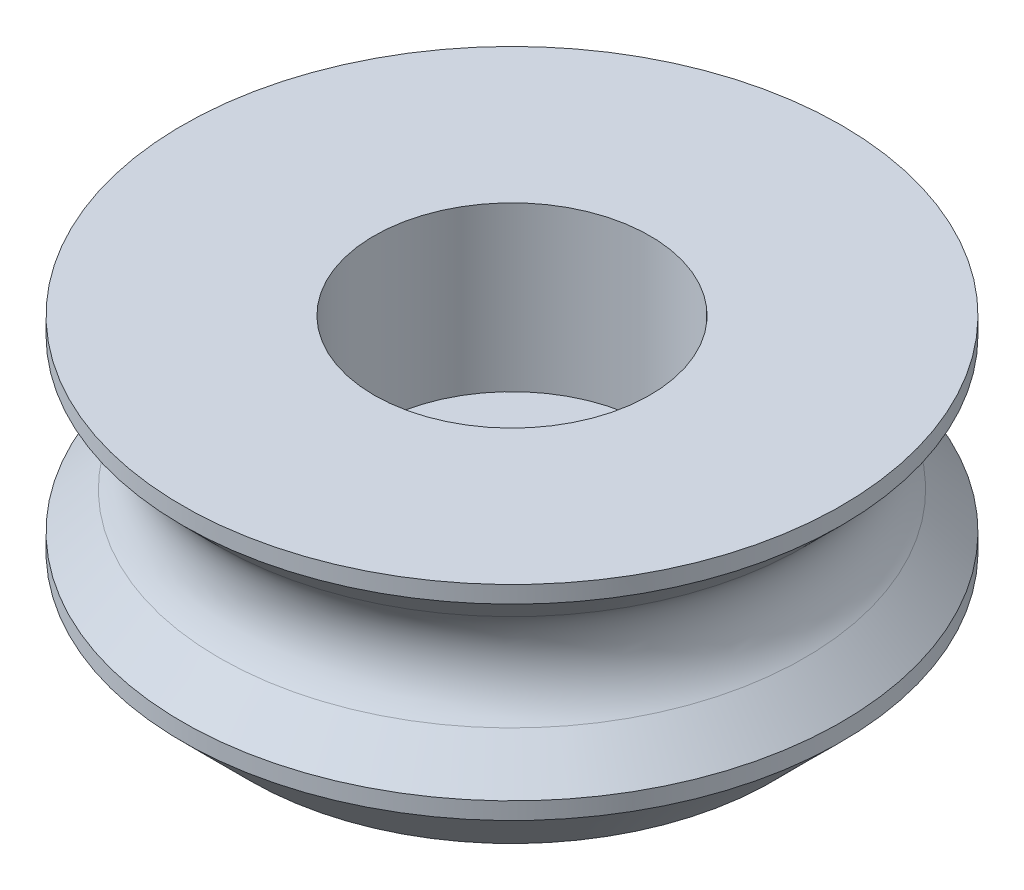
ISO-10303-21;
HEADER;
FILE_DESCRIPTION(('STEP AP214'),'2;1');
FILE_NAME('part.step','',(''),(''),'','','');
FILE_SCHEMA(('AUTOMOTIVE_DESIGN { 1 0 10303 214 1 1 1 1 }'));
ENDSEC;
DATA;
#1=APPLICATION_CONTEXT('core data for automotive mechanical design processes');
#2=APPLICATION_PROTOCOL_DEFINITION('international standard','automotive_design',2000,#1);
#3=PRODUCT_CONTEXT('',#1,'mechanical');
#4=PRODUCT('Part','Part','',(#3));
#5=PRODUCT_RELATED_PRODUCT_CATEGORY('part','',(#4));
#6=PRODUCT_DEFINITION_FORMATION('','',#4);
#7=PRODUCT_DEFINITION_CONTEXT('part definition',#1,'design');
#8=PRODUCT_DEFINITION('design','',#6,#7);
#9=PRODUCT_DEFINITION_SHAPE('','',#8);
#10=(LENGTH_UNIT() NAMED_UNIT(*) SI_UNIT(.MILLI.,.METRE.));
#11=(NAMED_UNIT(*) PLANE_ANGLE_UNIT() SI_UNIT($,.RADIAN.));
#12=(NAMED_UNIT(*) SI_UNIT($,.STERADIAN.) SOLID_ANGLE_UNIT());
#13=UNCERTAINTY_MEASURE_WITH_UNIT(LENGTH_MEASURE(1.E-05),#10,'distance_accuracy_value','');
#14=(GEOMETRIC_REPRESENTATION_CONTEXT(3) GLOBAL_UNCERTAINTY_ASSIGNED_CONTEXT((#13)) GLOBAL_UNIT_ASSIGNED_CONTEXT((#10,
#11,#12)) REPRESENTATION_CONTEXT('',''));
#15=CARTESIAN_POINT('',(0.,0.,0.));
#16=DIRECTION('',(0.,0.,1.));
#17=DIRECTION('',(1.,0.,0.));
#18=AXIS2_PLACEMENT_3D('',#15,#16,#17);
#19=CARTESIAN_POINT('',(9.67157287525382,-2.,0.));
#20=DIRECTION('',(0.,-1.,0.));
#21=DIRECTION('',(0.,0.,-1.));
#22=AXIS2_PLACEMENT_3D('',#19,#20,#21);
#23=PLANE('',#22);
#24=CARTESIAN_POINT('',(0.,-2.,0.));
#25=DIRECTION('',(0.,-1.,0.));
#26=DIRECTION('',(0.,0.,-1.));
#27=AXIS2_PLACEMENT_3D('',#24,#25,#26);
#28=CIRCLE('',#27,7.67157287525382);
#29=CARTESIAN_POINT('',(0.,-2.,-7.67157287525382));
#30=VERTEX_POINT('',#29);
#31=EDGE_CURVE('E46',#30,#30,#28,.T.);
#32=ORIENTED_EDGE('',*,*,#31,.T.);
#33=EDGE_LOOP('',(#32));
#34=FACE_BOUND('',#33,.T.);
#35=CARTESIAN_POINT('',(0.,-2.,0.));
#36=DIRECTION('',(0.,-1.,0.));
#37=DIRECTION('',(0.,0.,-1.));
#38=AXIS2_PLACEMENT_3D('',#35,#36,#37);
#39=CIRCLE('',#38,2.6);
#40=CARTESIAN_POINT('',(0.,-2.,-2.6));
#41=VERTEX_POINT('',#40);
#42=EDGE_CURVE('E67',#41,#41,#39,.T.);
#43=ORIENTED_EDGE('',*,*,#42,.F.);
#44=EDGE_LOOP('',(#43));
#45=FACE_BOUND('',#44,.T.);
#46=ADVANCED_FACE('F38',(#34,#45),#23,.T.);
#47=CARTESIAN_POINT('',(0.,0.,0.));
#48=DIRECTION('',(0.,-1.,0.));
#49=DIRECTION('',(0.,0.,-1.));
#50=AXIS2_PLACEMENT_3D('',#47,#48,#49);
#51=CYLINDRICAL_SURFACE('',#50,2.6);
#52=ORIENTED_EDGE('',*,*,#42,.T.);
#53=EDGE_LOOP('',(#52));
#54=FACE_BOUND('',#53,.T.);
#55=CARTESIAN_POINT('',(0.,1.2,0.));
#56=DIRECTION('',(0.,-1.,0.));
#57=DIRECTION('',(0.,0.,-1.));
#58=AXIS2_PLACEMENT_3D('',#55,#56,#57);
#59=CIRCLE('',#58,2.6);
#60=CARTESIAN_POINT('',(0.,1.2,-2.6));
#61=VERTEX_POINT('',#60);
#62=EDGE_CURVE('E64',#61,#61,#59,.T.);
#63=ORIENTED_EDGE('',*,*,#62,.F.);
#64=EDGE_LOOP('',(#63));
#65=FACE_BOUND('',#64,.T.);
#66=ADVANCED_FACE('F98',(#54,#65),#51,.F.);
#67=CARTESIAN_POINT('',(2.6,1.2,0.));
#68=DIRECTION('',(0.,1.,0.));
#69=DIRECTION('',(0.,0.,1.));
#70=AXIS2_PLACEMENT_3D('',#67,#68,#69);
#71=PLANE('',#70);
#72=ORIENTED_EDGE('',*,*,#62,.T.);
#73=EDGE_LOOP('',(#72));
#74=FACE_BOUND('',#73,.T.);
#75=CARTESIAN_POINT('',(0.,1.2,0.));
#76=DIRECTION('',(0.,1.,0.));
#77=DIRECTION('',(0.,0.,1.));
#78=AXIS2_PLACEMENT_3D('',#75,#76,#77);
#79=CIRCLE('',#78,4.05);
#80=CARTESIAN_POINT('',(0.,1.2,4.05));
#81=VERTEX_POINT('',#80);
#82=EDGE_CURVE('E60',#81,#81,#79,.F.);
#83=ORIENTED_EDGE('',*,*,#82,.F.);
#84=EDGE_LOOP('',(#83));
#85=FACE_BOUND('',#84,.T.);
#86=ADVANCED_FACE('F103',(#74,#85),#71,.T.);
#87=CARTESIAN_POINT('',(0.,0.,0.));
#88=DIRECTION('',(0.,-1.,0.));
#89=DIRECTION('',(0.,0.,-1.));
#90=AXIS2_PLACEMENT_3D('',#87,#88,#89);
#91=CYLINDRICAL_SURFACE('',#90,4.05);
#92=ORIENTED_EDGE('',*,*,#82,.T.);
#93=EDGE_LOOP('',(#92));
#94=FACE_BOUND('',#93,.T.);
#95=CARTESIAN_POINT('',(0.,6.,0.));
#96=DIRECTION('',(0.,1.,0.));
#97=DIRECTION('',(0.,0.,1.));
#98=AXIS2_PLACEMENT_3D('',#95,#96,#97);
#99=CIRCLE('',#98,4.05);
#100=CARTESIAN_POINT('',(0.,6.,4.05));
#101=VERTEX_POINT('',#100);
#102=EDGE_CURVE('E57',#101,#101,#99,.F.);
#103=ORIENTED_EDGE('',*,*,#102,.F.);
#104=EDGE_LOOP('',(#103));
#105=FACE_BOUND('',#104,.T.);
#106=ADVANCED_FACE('F110',(#94,#105),#91,.F.);
#107=CARTESIAN_POINT('',(4.,6.,0.));
#108=DIRECTION('',(0.,1.,0.));
#109=DIRECTION('',(0.,0.,1.));
#110=AXIS2_PLACEMENT_3D('',#107,#108,#109);
#111=PLANE('',#110);
#112=ORIENTED_EDGE('',*,*,#102,.T.);
#113=EDGE_LOOP('',(#112));
#114=FACE_BOUND('',#113,.T.);
#115=CARTESIAN_POINT('',(0.,6.,0.));
#116=DIRECTION('',(0.,-1.,0.));
#117=DIRECTION('',(0.,0.,-1.));
#118=AXIS2_PLACEMENT_3D('',#115,#116,#117);
#119=CIRCLE('',#118,9.67157287525382);
#120=CARTESIAN_POINT('',(0.,6.,-9.67157287525382));
#121=VERTEX_POINT('',#120);
#122=EDGE_CURVE('E61',#121,#121,#119,.T.);
#123=ORIENTED_EDGE('',*,*,#122,.F.);
#124=EDGE_LOOP('',(#123));
#125=FACE_BOUND('',#124,.T.);
#126=ADVANCED_FACE('F113',(#114,#125),#111,.T.);
#127=CARTESIAN_POINT('',(0.,0.,0.));
#128=DIRECTION('',(0.,-1.,0.));
#129=DIRECTION('',(0.,0.,-1.));
#130=AXIS2_PLACEMENT_3D('',#127,#128,#129);
#131=CYLINDRICAL_SURFACE('',#130,9.67157287525382);
#132=ORIENTED_EDGE('',*,*,#122,.T.);
#133=EDGE_LOOP('',(#132));
#134=FACE_BOUND('',#133,.T.);
#135=CARTESIAN_POINT('',(0.,5.5,0.));
#136=DIRECTION('',(0.,-1.,0.));
#137=DIRECTION('',(0.,0.,-1.));
#138=AXIS2_PLACEMENT_3D('',#135,#136,#137);
#139=CIRCLE('',#138,9.67157287525382);
#140=CARTESIAN_POINT('',(0.,5.5,-9.67157287525382));
#141=VERTEX_POINT('',#140);
#142=EDGE_CURVE('E74',#141,#141,#139,.T.);
#143=ORIENTED_EDGE('',*,*,#142,.F.);
#144=EDGE_LOOP('',(#143));
#145=FACE_BOUND('',#144,.T.);
#146=ADVANCED_FACE('F94',(#134,#145),#131,.T.);
#147=CARTESIAN_POINT('',(0.,3.,0.));
#148=DIRECTION('',(0.,1.,0.));
#149=DIRECTION('',(0.,0.,1.));
#150=AXIS2_PLACEMENT_3D('',#147,#148,#149);
#151=CONICAL_SURFACE('',#150,7.1715728752538,0.78539816339745);
#152=CARTESIAN_POINT('',(0.,4.4142135623731,0.));
#153=DIRECTION('',(0.,1.,0.));
#154=DIRECTION('',(0.,0.,1.));
#155=AXIS2_PLACEMENT_3D('',#152,#153,#154);
#156=CIRCLE('',#155,8.58578643762691);
#157=CARTESIAN_POINT('',(0.,4.4142135623731,8.58578643762691));
#158=VERTEX_POINT('',#157);
#159=EDGE_CURVE('E50',#158,#158,#156,.T.);
#160=ORIENTED_EDGE('',*,*,#159,.T.);
#161=EDGE_LOOP('',(#160));
#162=FACE_BOUND('',#161,.T.);
#163=ORIENTED_EDGE('',*,*,#142,.T.);
#164=EDGE_LOOP('',(#163));
#165=FACE_BOUND('',#164,.T.);
#166=ADVANCED_FACE('F85',(#162,#165),#151,.T.);
#167=CARTESIAN_POINT('',(0.,0.499999999999999,0.));
#168=DIRECTION('',(0.,-1.,0.));
#169=DIRECTION('',(0.,0.,-1.));
#170=AXIS2_PLACEMENT_3D('',#167,#168,#169);
#171=CONICAL_SURFACE('',#170,9.67157287525382,0.785398163397451);
#172=CARTESIAN_POINT('',(0.,1.5857864376269,0.));
#173=DIRECTION('',(0.,-1.,0.));
#174=DIRECTION('',(0.,0.,-1.));
#175=AXIS2_PLACEMENT_3D('',#172,#173,#174);
#176=CIRCLE('',#175,8.58578643762691);
#177=CARTESIAN_POINT('',(0.,1.5857864376269,-8.58578643762691));
#178=VERTEX_POINT('',#177);
#179=EDGE_CURVE('E54',#178,#178,#176,.T.);
#180=ORIENTED_EDGE('',*,*,#179,.T.);
#181=EDGE_LOOP('',(#180));
#182=FACE_BOUND('',#181,.T.);
#183=CARTESIAN_POINT('',(0.,0.499999999999999,0.));
#184=DIRECTION('',(0.,-1.,0.));
#185=DIRECTION('',(0.,0.,-1.));
#186=AXIS2_PLACEMENT_3D('',#183,#184,#185);
#187=CIRCLE('',#186,9.67157287525382);
#188=CARTESIAN_POINT('',(0.,0.499999999999999,-9.67157287525382));
#189=VERTEX_POINT('',#188);
#190=EDGE_CURVE('E77',#189,#189,#187,.T.);
#191=ORIENTED_EDGE('',*,*,#190,.F.);
#192=EDGE_LOOP('',(#191));
#193=FACE_BOUND('',#192,.T.);
#194=ADVANCED_FACE('F83',(#182,#193),#171,.T.);
#195=CARTESIAN_POINT('',(0.,0.,0.));
#196=DIRECTION('',(0.,-1.,0.));
#197=DIRECTION('',(0.,0.,-1.));
#198=AXIS2_PLACEMENT_3D('',#195,#196,#197);
#199=CYLINDRICAL_SURFACE('',#198,9.67157287525382);
#200=CARTESIAN_POINT('',(0.,0.,0.));
#201=DIRECTION('',(0.,-1.,0.));
#202=DIRECTION('',(0.,0.,-1.));
#203=AXIS2_PLACEMENT_3D('',#200,#201,#202);
#204=CIRCLE('',#203,9.67157287525382);
#205=CARTESIAN_POINT('',(0.,0.,-9.67157287525382));
#206=VERTEX_POINT('',#205);
#207=EDGE_CURVE('E11',#206,#206,#204,.F.);
#208=ORIENTED_EDGE('',*,*,#207,.T.);
#209=EDGE_LOOP('',(#208));
#210=FACE_BOUND('',#209,.T.);
#211=ORIENTED_EDGE('',*,*,#190,.T.);
#212=EDGE_LOOP('',(#211));
#213=FACE_BOUND('',#212,.T.);
#214=ADVANCED_FACE('F81',(#210,#213),#199,.T.);
#215=CARTESIAN_POINT('',(0.,3.,0.));
#216=DIRECTION('',(0.,-1.,0.));
#217=DIRECTION('',(0.,0.,-1.));
#218=AXIS2_PLACEMENT_3D('',#215,#216,#217);
#219=TOROIDAL_SURFACE('',#218,10.,2.);
#220=ORIENTED_EDGE('',*,*,#159,.F.);
#221=EDGE_LOOP('',(#220));
#222=FACE_BOUND('',#221,.T.);
#223=ORIENTED_EDGE('',*,*,#179,.F.);
#224=EDGE_LOOP('',(#223));
#225=FACE_BOUND('',#224,.T.);
#226=ADVANCED_FACE('F92',(#222,#225),#219,.F.);
#227=CARTESIAN_POINT('',(0.,-2.,0.));
#228=DIRECTION('',(0.,1.,0.));
#229=DIRECTION('',(0.,0.,1.));
#230=AXIS2_PLACEMENT_3D('',#227,#228,#229);
#231=CONICAL_SURFACE('',#230,7.67157287525382,0.785398163397447);
#232=ORIENTED_EDGE('',*,*,#207,.F.);
#233=EDGE_LOOP('',(#232));
#234=FACE_BOUND('',#233,.T.);
#235=ORIENTED_EDGE('',*,*,#31,.F.);
#236=EDGE_LOOP('',(#235));
#237=FACE_BOUND('',#236,.T.);
#238=ADVANCED_FACE('F41',(#234,#237),#231,.T.);
#239=CLOSED_SHELL('',(#46,#66,#86,#106,#126,#146,#166,#194,#214,#226,#238));
#240=MANIFOLD_SOLID_BREP('B2',#239);
#241=ADVANCED_BREP_SHAPE_REPRESENTATION('',(#18,#240),#14);
#242=SHAPE_DEFINITION_REPRESENTATION(#9,#241);
ENDSEC;
END-ISO-10303-21;
